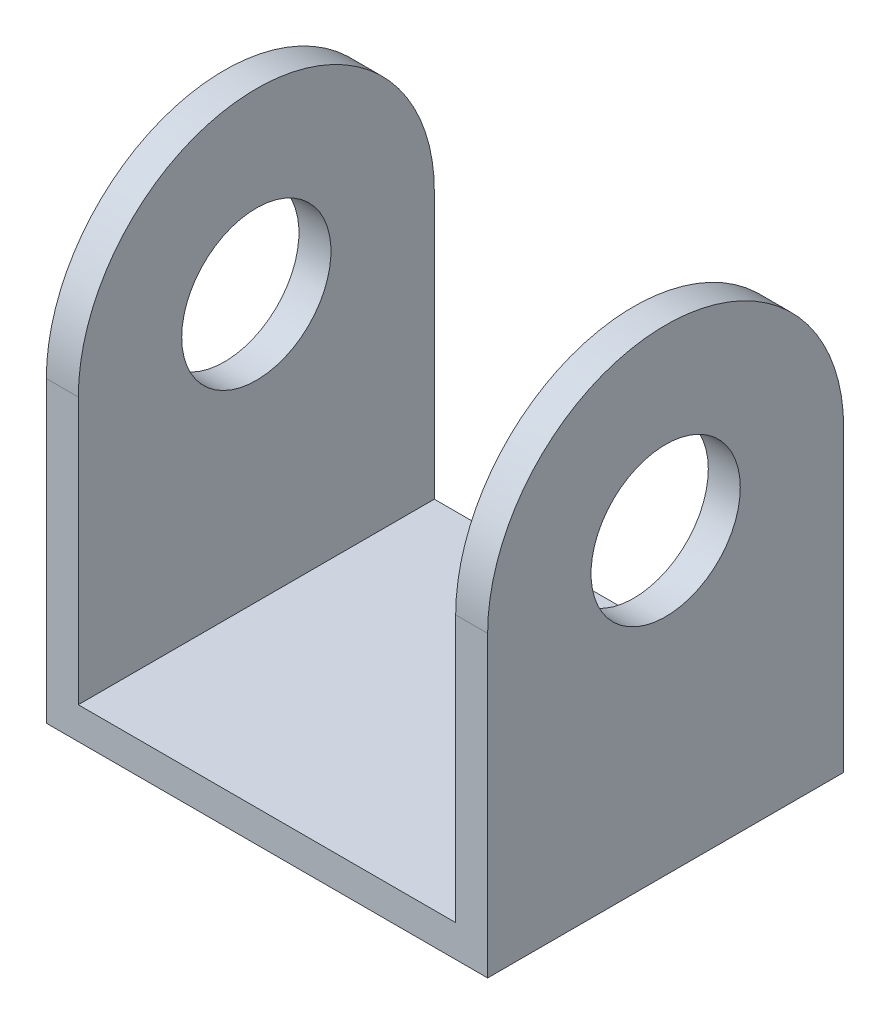
ISO-10303-21;
HEADER;
FILE_DESCRIPTION(('STEP AP214'),'2;1');
FILE_NAME('part.step','',(''),(''),'','','');
FILE_SCHEMA(('AUTOMOTIVE_DESIGN { 1 0 10303 214 1 1 1 1 }'));
ENDSEC;
DATA;
#1=APPLICATION_CONTEXT('core data for automotive mechanical design processes');
#2=APPLICATION_PROTOCOL_DEFINITION('international standard','automotive_design',2000,#1);
#3=PRODUCT_CONTEXT('',#1,'mechanical');
#4=PRODUCT('Part','Part','',(#3));
#5=PRODUCT_RELATED_PRODUCT_CATEGORY('part','',(#4));
#6=PRODUCT_DEFINITION_FORMATION('','',#4);
#7=PRODUCT_DEFINITION_CONTEXT('part definition',#1,'design');
#8=PRODUCT_DEFINITION('design','',#6,#7);
#9=PRODUCT_DEFINITION_SHAPE('','',#8);
#10=(LENGTH_UNIT() NAMED_UNIT(*) SI_UNIT(.MILLI.,.METRE.));
#11=(NAMED_UNIT(*) PLANE_ANGLE_UNIT() SI_UNIT($,.RADIAN.));
#12=(NAMED_UNIT(*) SI_UNIT($,.STERADIAN.) SOLID_ANGLE_UNIT());
#13=UNCERTAINTY_MEASURE_WITH_UNIT(LENGTH_MEASURE(1.E-05),#10,'distance_accuracy_value','');
#14=(GEOMETRIC_REPRESENTATION_CONTEXT(3) GLOBAL_UNCERTAINTY_ASSIGNED_CONTEXT((#13)) GLOBAL_UNIT_ASSIGNED_CONTEXT((#10,
#11,#12)) REPRESENTATION_CONTEXT('',''));
#15=CARTESIAN_POINT('',(0.,0.,0.));
#16=DIRECTION('',(0.,0.,1.));
#17=DIRECTION('',(1.,0.,0.));
#18=AXIS2_PLACEMENT_3D('',#15,#16,#17);
#19=CARTESIAN_POINT('',(-38.4,0.,16.7));
#20=DIRECTION('',(0.,1.,0.));
#21=DIRECTION('',(0.,0.,1.));
#22=AXIS2_PLACEMENT_3D('',#19,#20,#21);
#23=PLANE('',#22);
#24=DIRECTION('',(1.,0.,0.));
#25=VECTOR('',#24,1.);
#26=CARTESIAN_POINT('',(-38.4,0.,-16.7));
#27=LINE('',#26,#25);
#28=CARTESIAN_POINT('',(-35.4,0.,-16.7));
#29=VERTEX_POINT('',#28);
#30=CARTESIAN_POINT('',(0.,0.,-16.7));
#31=VERTEX_POINT('',#30);
#32=EDGE_CURVE('E37',#29,#31,#27,.T.);
#33=ORIENTED_EDGE('',*,*,#32,.F.);
#34=DIRECTION('',(0.,0.,-1.));
#35=VECTOR('',#34,1.);
#36=CARTESIAN_POINT('',(-35.4,0.,0.));
#37=LINE('',#36,#35);
#38=CARTESIAN_POINT('',(-35.4,0.,16.7));
#39=VERTEX_POINT('',#38);
#40=EDGE_CURVE('E54',#39,#29,#37,.T.);
#41=ORIENTED_EDGE('',*,*,#40,.F.);
#42=DIRECTION('',(1.,0.,0.));
#43=VECTOR('',#42,1.);
#44=CARTESIAN_POINT('',(-38.4,0.,16.7));
#45=LINE('',#44,#43);
#46=CARTESIAN_POINT('',(0.,0.,16.7));
#47=VERTEX_POINT('',#46);
#48=EDGE_CURVE('E121',#39,#47,#45,.T.);
#49=ORIENTED_EDGE('',*,*,#48,.T.);
#50=DIRECTION('',(0.,0.,-1.));
#51=VECTOR('',#50,1.);
#52=CARTESIAN_POINT('',(0.,0.,-16.7));
#53=LINE('',#52,#51);
#54=EDGE_CURVE('E154',#47,#31,#53,.T.);
#55=ORIENTED_EDGE('',*,*,#54,.T.);
#56=EDGE_LOOP('',(#33,#41,#49,#55));
#57=FACE_BOUND('',#56,.T.);
#58=ADVANCED_FACE('F33',(#57),#23,.T.);
#59=CARTESIAN_POINT('',(3.,25.,0.));
#60=DIRECTION('',(1.,0.,0.));
#61=DIRECTION('',(0.,0.,-1.));
#62=AXIS2_PLACEMENT_3D('',#59,#60,#61);
#63=PLANE('',#62);
#64=CARTESIAN_POINT('',(3.,25.,0.));
#65=DIRECTION('',(1.,0.,0.));
#66=DIRECTION('',(0.,0.,-1.));
#67=AXIS2_PLACEMENT_3D('',#64,#65,#66);
#68=CIRCLE('',#67,16.7);
#69=CARTESIAN_POINT('',(3.,25.,-16.7));
#70=VERTEX_POINT('',#69);
#71=CARTESIAN_POINT('',(3.,25.,16.7));
#72=VERTEX_POINT('',#71);
#73=EDGE_CURVE('E167',#70,#72,#68,.T.);
#74=ORIENTED_EDGE('',*,*,#73,.T.);
#75=DIRECTION('',(0.,-1.,0.));
#76=VECTOR('',#75,1.);
#77=CARTESIAN_POINT('',(3.,25.,16.7));
#78=LINE('',#77,#76);
#79=CARTESIAN_POINT('',(3.,-3.,16.7));
#80=VERTEX_POINT('',#79);
#81=EDGE_CURVE('E172',#72,#80,#78,.T.);
#82=ORIENTED_EDGE('',*,*,#81,.T.);
#83=DIRECTION('',(0.,0.,-1.));
#84=VECTOR('',#83,1.);
#85=CARTESIAN_POINT('',(3.,-3.,-16.7));
#86=LINE('',#85,#84);
#87=CARTESIAN_POINT('',(3.,-3.,-16.7));
#88=VERTEX_POINT('',#87);
#89=EDGE_CURVE('E133',#80,#88,#86,.T.);
#90=ORIENTED_EDGE('',*,*,#89,.T.);
#91=DIRECTION('',(0.,1.,0.));
#92=VECTOR('',#91,1.);
#93=CARTESIAN_POINT('',(3.,25.,-16.7));
#94=LINE('',#93,#92);
#95=EDGE_CURVE('E166',#88,#70,#94,.T.);
#96=ORIENTED_EDGE('',*,*,#95,.T.);
#97=EDGE_LOOP('',(#74,#82,#90,#96));
#98=FACE_BOUND('',#97,.T.);
#99=CARTESIAN_POINT('',(3.,25.,0.));
#100=DIRECTION('',(1.,0.,0.));
#101=DIRECTION('',(0.,0.,-1.));
#102=AXIS2_PLACEMENT_3D('',#99,#100,#101);
#103=CIRCLE('',#102,7.00000000249259);
#104=CARTESIAN_POINT('',(3.,25.,-7.00000000249259));
#105=VERTEX_POINT('',#104);
#106=EDGE_CURVE('E196',#105,#105,#103,.T.);
#107=ORIENTED_EDGE('',*,*,#106,.F.);
#108=EDGE_LOOP('',(#107));
#109=FACE_BOUND('',#108,.T.);
#110=ADVANCED_FACE('F180',(#98,#109),#63,.T.);
#111=CARTESIAN_POINT('',(0.,25.,0.));
#112=DIRECTION('',(1.,0.,0.));
#113=DIRECTION('',(0.,0.,-1.));
#114=AXIS2_PLACEMENT_3D('',#111,#112,#113);
#115=PLANE('',#114);
#116=CARTESIAN_POINT('',(0.,25.,0.));
#117=DIRECTION('',(1.,0.,0.));
#118=DIRECTION('',(0.,0.,-1.));
#119=AXIS2_PLACEMENT_3D('',#116,#117,#118);
#120=CIRCLE('',#119,16.7);
#121=CARTESIAN_POINT('',(0.,25.,-16.7));
#122=VERTEX_POINT('',#121);
#123=CARTESIAN_POINT('',(0.,25.,16.7));
#124=VERTEX_POINT('',#123);
#125=EDGE_CURVE('E155',#122,#124,#120,.T.);
#126=ORIENTED_EDGE('',*,*,#125,.F.);
#127=DIRECTION('',(0.,1.,0.));
#128=VECTOR('',#127,1.);
#129=CARTESIAN_POINT('',(0.,25.,-16.7));
#130=LINE('',#129,#128);
#131=EDGE_CURVE('E158',#31,#122,#130,.T.);
#132=ORIENTED_EDGE('',*,*,#131,.F.);
#133=ORIENTED_EDGE('',*,*,#54,.F.);
#134=DIRECTION('',(0.,-1.,0.));
#135=VECTOR('',#134,1.);
#136=CARTESIAN_POINT('',(0.,25.,16.7));
#137=LINE('',#136,#135);
#138=EDGE_CURVE('E152',#124,#47,#137,.T.);
#139=ORIENTED_EDGE('',*,*,#138,.F.);
#140=EDGE_LOOP('',(#126,#132,#133,#139));
#141=FACE_BOUND('',#140,.T.);
#142=CARTESIAN_POINT('',(0.,25.,0.));
#143=DIRECTION('',(1.,0.,0.));
#144=DIRECTION('',(0.,0.,-1.));
#145=AXIS2_PLACEMENT_3D('',#142,#143,#144);
#146=CIRCLE('',#145,7.00000000249259);
#147=CARTESIAN_POINT('',(0.,25.,-7.00000000249259));
#148=VERTEX_POINT('',#147);
#149=EDGE_CURVE('E149',#148,#148,#146,.T.);
#150=ORIENTED_EDGE('',*,*,#149,.T.);
#151=EDGE_LOOP('',(#150));
#152=FACE_BOUND('',#151,.T.);
#153=ADVANCED_FACE('F203',(#141,#152),#115,.F.);
#154=CARTESIAN_POINT('',(3.,25.,0.));
#155=DIRECTION('',(-1.,0.,0.));
#156=DIRECTION('',(0.,0.,1.));
#157=AXIS2_PLACEMENT_3D('',#154,#155,#156);
#158=CYLINDRICAL_SURFACE('',#157,16.7);
#159=ORIENTED_EDGE('',*,*,#125,.T.);
#160=DIRECTION('',(-1.,0.,0.));
#161=VECTOR('',#160,1.);
#162=CARTESIAN_POINT('',(3.,25.,16.7));
#163=LINE('',#162,#161);
#164=EDGE_CURVE('E11',#72,#124,#163,.T.);
#165=ORIENTED_EDGE('',*,*,#164,.F.);
#166=ORIENTED_EDGE('',*,*,#73,.F.);
#167=DIRECTION('',(-1.,0.,0.));
#168=VECTOR('',#167,1.);
#169=CARTESIAN_POINT('',(3.,25.,-16.7));
#170=LINE('',#169,#168);
#171=EDGE_CURVE('E43',#70,#122,#170,.T.);
#172=ORIENTED_EDGE('',*,*,#171,.T.);
#173=EDGE_LOOP('',(#159,#165,#166,#172));
#174=FACE_BOUND('',#173,.T.);
#175=ADVANCED_FACE('F35',(#174),#158,.T.);
#176=CARTESIAN_POINT('',(3.,25.,16.7));
#177=DIRECTION('',(0.,0.,-1.));
#178=DIRECTION('',(-1.,0.,0.));
#179=AXIS2_PLACEMENT_3D('',#176,#177,#178);
#180=PLANE('',#179);
#181=ORIENTED_EDGE('',*,*,#138,.T.);
#182=ORIENTED_EDGE('',*,*,#48,.F.);
#183=DIRECTION('',(0.,1.,0.));
#184=VECTOR('',#183,1.);
#185=CARTESIAN_POINT('',(-35.4,0.,16.7));
#186=LINE('',#185,#184);
#187=CARTESIAN_POINT('',(-35.4,25.,16.7));
#188=VERTEX_POINT('',#187);
#189=EDGE_CURVE('E115',#39,#188,#186,.T.);
#190=ORIENTED_EDGE('',*,*,#189,.T.);
#191=DIRECTION('',(-1.,0.,0.));
#192=VECTOR('',#191,1.);
#193=CARTESIAN_POINT('',(-35.4,25.,16.7));
#194=LINE('',#193,#192);
#195=CARTESIAN_POINT('',(-38.4,25.,16.7));
#196=VERTEX_POINT('',#195);
#197=EDGE_CURVE('E99',#188,#196,#194,.T.);
#198=ORIENTED_EDGE('',*,*,#197,.T.);
#199=DIRECTION('',(0.,-1.,0.));
#200=VECTOR('',#199,1.);
#201=CARTESIAN_POINT('',(-38.4,-3.,16.7));
#202=LINE('',#201,#200);
#203=CARTESIAN_POINT('',(-38.4,-3.,16.7));
#204=VERTEX_POINT('',#203);
#205=EDGE_CURVE('E135',#196,#204,#202,.T.);
#206=ORIENTED_EDGE('',*,*,#205,.T.);
#207=DIRECTION('',(1.,0.,0.));
#208=VECTOR('',#207,1.);
#209=CARTESIAN_POINT('',(-38.4,-3.,16.7));
#210=LINE('',#209,#208);
#211=EDGE_CURVE('E142',#204,#80,#210,.T.);
#212=ORIENTED_EDGE('',*,*,#211,.T.);
#213=ORIENTED_EDGE('',*,*,#81,.F.);
#214=ORIENTED_EDGE('',*,*,#164,.T.);
#215=EDGE_LOOP('',(#181,#182,#190,#198,#206,#212,#213,#214));
#216=FACE_BOUND('',#215,.T.);
#217=ADVANCED_FACE('F120',(#216),#180,.F.);
#218=CARTESIAN_POINT('',(3.,25.,-16.7));
#219=DIRECTION('',(0.,0.,1.));
#220=DIRECTION('',(1.,0.,0.));
#221=AXIS2_PLACEMENT_3D('',#218,#219,#220);
#222=PLANE('',#221);
#223=ORIENTED_EDGE('',*,*,#131,.T.);
#224=ORIENTED_EDGE('',*,*,#171,.F.);
#225=ORIENTED_EDGE('',*,*,#95,.F.);
#226=DIRECTION('',(1.,0.,0.));
#227=VECTOR('',#226,1.);
#228=CARTESIAN_POINT('',(-38.4,-3.,-16.7));
#229=LINE('',#228,#227);
#230=CARTESIAN_POINT('',(-38.4,-3.,-16.7));
#231=VERTEX_POINT('',#230);
#232=EDGE_CURVE('E192',#231,#88,#229,.T.);
#233=ORIENTED_EDGE('',*,*,#232,.F.);
#234=DIRECTION('',(0.,1.,0.));
#235=VECTOR('',#234,1.);
#236=CARTESIAN_POINT('',(-38.4,0.,-16.7));
#237=LINE('',#236,#235);
#238=CARTESIAN_POINT('',(-38.4,25.,-16.7));
#239=VERTEX_POINT('',#238);
#240=EDGE_CURVE('E140',#231,#239,#237,.T.);
#241=ORIENTED_EDGE('',*,*,#240,.T.);
#242=DIRECTION('',(-1.,0.,0.));
#243=VECTOR('',#242,1.);
#244=CARTESIAN_POINT('',(-35.4,25.,-16.7));
#245=LINE('',#244,#243);
#246=CARTESIAN_POINT('',(-35.4,25.,-16.7));
#247=VERTEX_POINT('',#246);
#248=EDGE_CURVE('E109',#247,#239,#245,.T.);
#249=ORIENTED_EDGE('',*,*,#248,.F.);
#250=DIRECTION('',(0.,-1.,0.));
#251=VECTOR('',#250,1.);
#252=CARTESIAN_POINT('',(-35.4,0.,-16.7));
#253=LINE('',#252,#251);
#254=EDGE_CURVE('E117',#247,#29,#253,.T.);
#255=ORIENTED_EDGE('',*,*,#254,.T.);
#256=ORIENTED_EDGE('',*,*,#32,.T.);
#257=EDGE_LOOP('',(#223,#224,#225,#233,#241,#249,#255,#256));
#258=FACE_BOUND('',#257,.T.);
#259=ADVANCED_FACE('F184',(#258),#222,.F.);
#260=CARTESIAN_POINT('',(3.,25.,0.));
#261=DIRECTION('',(-1.,0.,0.));
#262=DIRECTION('',(0.,0.,1.));
#263=AXIS2_PLACEMENT_3D('',#260,#261,#262);
#264=CYLINDRICAL_SURFACE('',#263,7.00000000249259);
#265=ORIENTED_EDGE('',*,*,#106,.T.);
#266=EDGE_LOOP('',(#265));
#267=FACE_BOUND('',#266,.T.);
#268=ORIENTED_EDGE('',*,*,#149,.F.);
#269=EDGE_LOOP('',(#268));
#270=FACE_BOUND('',#269,.T.);
#271=ADVANCED_FACE('F205',(#267,#270),#264,.F.);
#272=CARTESIAN_POINT('',(-38.4,-3.,-16.7));
#273=DIRECTION('',(0.,-1.,0.));
#274=DIRECTION('',(0.,0.,-1.));
#275=AXIS2_PLACEMENT_3D('',#272,#273,#274);
#276=PLANE('',#275);
#277=ORIENTED_EDGE('',*,*,#89,.F.);
#278=ORIENTED_EDGE('',*,*,#211,.F.);
#279=DIRECTION('',(0.,0.,-1.));
#280=VECTOR('',#279,1.);
#281=CARTESIAN_POINT('',(-38.4,-3.,-16.7));
#282=LINE('',#281,#280);
#283=EDGE_CURVE('E137',#204,#231,#282,.T.);
#284=ORIENTED_EDGE('',*,*,#283,.T.);
#285=ORIENTED_EDGE('',*,*,#232,.T.);
#286=EDGE_LOOP('',(#277,#278,#284,#285));
#287=FACE_BOUND('',#286,.T.);
#288=ADVANCED_FACE('F194',(#287),#276,.T.);
#289=CARTESIAN_POINT('',(-38.4,0.,0.));
#290=DIRECTION('',(-1.,0.,0.));
#291=DIRECTION('',(0.,0.,1.));
#292=AXIS2_PLACEMENT_3D('',#289,#290,#291);
#293=PLANE('',#292);
#294=ORIENTED_EDGE('',*,*,#205,.F.);
#295=CARTESIAN_POINT('',(-38.4,25.,0.));
#296=DIRECTION('',(-1.,0.,0.));
#297=DIRECTION('',(0.,0.,1.));
#298=AXIS2_PLACEMENT_3D('',#295,#296,#297);
#299=CIRCLE('',#298,16.7);
#300=EDGE_CURVE('E105',#196,#239,#299,.T.);
#301=ORIENTED_EDGE('',*,*,#300,.T.);
#302=ORIENTED_EDGE('',*,*,#240,.F.);
#303=ORIENTED_EDGE('',*,*,#283,.F.);
#304=EDGE_LOOP('',(#294,#301,#302,#303));
#305=FACE_BOUND('',#304,.T.);
#306=CARTESIAN_POINT('',(-38.4,25.,0.));
#307=DIRECTION('',(-1.,0.,0.));
#308=DIRECTION('',(0.,0.,1.));
#309=AXIS2_PLACEMENT_3D('',#306,#307,#308);
#310=CIRCLE('',#309,7.00000000249259);
#311=CARTESIAN_POINT('',(-38.4,25.,7.00000000249259));
#312=VERTEX_POINT('',#311);
#313=EDGE_CURVE('E129',#312,#312,#310,.T.);
#314=ORIENTED_EDGE('',*,*,#313,.F.);
#315=EDGE_LOOP('',(#314));
#316=FACE_BOUND('',#315,.T.);
#317=ADVANCED_FACE('F212',(#305,#316),#293,.T.);
#318=CARTESIAN_POINT('',(-35.4,25.,0.));
#319=DIRECTION('',(-1.,0.,0.));
#320=DIRECTION('',(0.,0.,1.));
#321=AXIS2_PLACEMENT_3D('',#318,#319,#320);
#322=CYLINDRICAL_SURFACE('',#321,7.00000000249259);
#323=CARTESIAN_POINT('',(-35.4,25.,0.));
#324=DIRECTION('',(-1.,0.,0.));
#325=DIRECTION('',(0.,0.,1.));
#326=AXIS2_PLACEMENT_3D('',#323,#324,#325);
#327=CIRCLE('',#326,7.00000000249259);
#328=CARTESIAN_POINT('',(-35.4,25.,7.00000000249259));
#329=VERTEX_POINT('',#328);
#330=EDGE_CURVE('E122',#329,#329,#327,.T.);
#331=ORIENTED_EDGE('',*,*,#330,.F.);
#332=EDGE_LOOP('',(#331));
#333=FACE_BOUND('',#332,.T.);
#334=ORIENTED_EDGE('',*,*,#313,.T.);
#335=EDGE_LOOP('',(#334));
#336=FACE_BOUND('',#335,.T.);
#337=ADVANCED_FACE('F224',(#333,#336),#322,.F.);
#338=CARTESIAN_POINT('',(-35.4,25.,0.));
#339=DIRECTION('',(-1.,0.,0.));
#340=DIRECTION('',(0.,0.,1.));
#341=AXIS2_PLACEMENT_3D('',#338,#339,#340);
#342=CYLINDRICAL_SURFACE('',#341,16.7);
#343=ORIENTED_EDGE('',*,*,#300,.F.);
#344=ORIENTED_EDGE('',*,*,#197,.F.);
#345=CARTESIAN_POINT('',(-35.4,25.,0.));
#346=DIRECTION('',(-1.,0.,0.));
#347=DIRECTION('',(0.,0.,1.));
#348=AXIS2_PLACEMENT_3D('',#345,#346,#347);
#349=CIRCLE('',#348,16.7);
#350=EDGE_CURVE('E103',#188,#247,#349,.T.);
#351=ORIENTED_EDGE('',*,*,#350,.T.);
#352=ORIENTED_EDGE('',*,*,#248,.T.);
#353=EDGE_LOOP('',(#343,#344,#351,#352));
#354=FACE_BOUND('',#353,.T.);
#355=ADVANCED_FACE('F101',(#354),#342,.T.);
#356=CARTESIAN_POINT('',(-35.4,0.,0.));
#357=DIRECTION('',(-1.,0.,0.));
#358=DIRECTION('',(0.,0.,1.));
#359=AXIS2_PLACEMENT_3D('',#356,#357,#358);
#360=PLANE('',#359);
#361=ORIENTED_EDGE('',*,*,#330,.T.);
#362=EDGE_LOOP('',(#361));
#363=FACE_BOUND('',#362,.T.);
#364=ORIENTED_EDGE('',*,*,#189,.F.);
#365=ORIENTED_EDGE('',*,*,#40,.T.);
#366=ORIENTED_EDGE('',*,*,#254,.F.);
#367=ORIENTED_EDGE('',*,*,#350,.F.);
#368=EDGE_LOOP('',(#364,#365,#366,#367));
#369=FACE_BOUND('',#368,.T.);
#370=ADVANCED_FACE('F114',(#363,#369),#360,.F.);
#371=CLOSED_SHELL('',(#58,#110,#153,#175,#217,#259,#271,#288,#317,#337,#355,#370));
#372=MANIFOLD_SOLID_BREP('B2',#371);
#373=ADVANCED_BREP_SHAPE_REPRESENTATION('',(#18,#372),#14);
#374=SHAPE_DEFINITION_REPRESENTATION(#9,#373);
ENDSEC;
END-ISO-10303-21;
